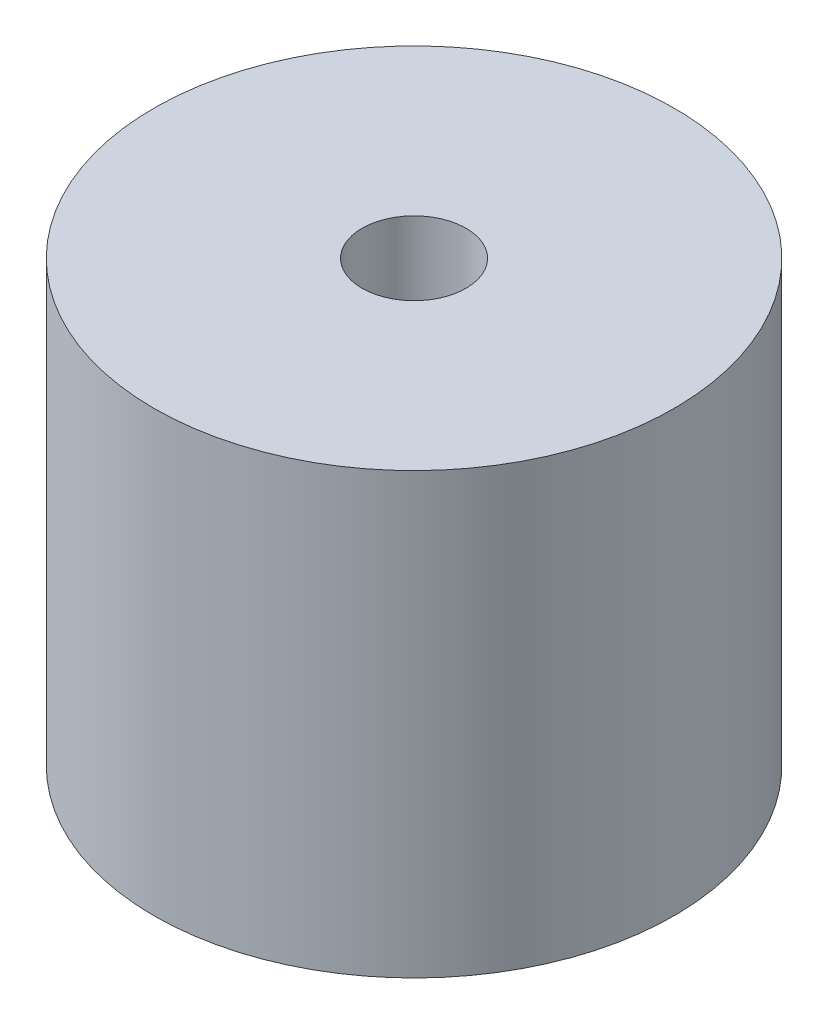
ISO-10303-21;
HEADER;
FILE_DESCRIPTION(('STEP AP214'),'2;1');
FILE_NAME('part.step','',(''),(''),'','','');
FILE_SCHEMA(('AUTOMOTIVE_DESIGN { 1 0 10303 214 1 1 1 1 }'));
ENDSEC;
DATA;
#1=APPLICATION_CONTEXT('core data for automotive mechanical design processes');
#2=APPLICATION_PROTOCOL_DEFINITION('international standard','automotive_design',2000,#1);
#3=PRODUCT_CONTEXT('',#1,'mechanical');
#4=PRODUCT('Part','Part','',(#3));
#5=PRODUCT_RELATED_PRODUCT_CATEGORY('part','',(#4));
#6=PRODUCT_DEFINITION_FORMATION('','',#4);
#7=PRODUCT_DEFINITION_CONTEXT('part definition',#1,'design');
#8=PRODUCT_DEFINITION('design','',#6,#7);
#9=PRODUCT_DEFINITION_SHAPE('','',#8);
#10=(LENGTH_UNIT() NAMED_UNIT(*) SI_UNIT(.MILLI.,.METRE.));
#11=(NAMED_UNIT(*) PLANE_ANGLE_UNIT() SI_UNIT($,.RADIAN.));
#12=(NAMED_UNIT(*) SI_UNIT($,.STERADIAN.) SOLID_ANGLE_UNIT());
#13=UNCERTAINTY_MEASURE_WITH_UNIT(LENGTH_MEASURE(1.E-05),#10,'distance_accuracy_value','');
#14=(GEOMETRIC_REPRESENTATION_CONTEXT(3) GLOBAL_UNCERTAINTY_ASSIGNED_CONTEXT((#13)) GLOBAL_UNIT_ASSIGNED_CONTEXT((#10,
#11,#12)) REPRESENTATION_CONTEXT('',''));
#15=CARTESIAN_POINT('',(0.,0.,0.));
#16=DIRECTION('',(0.,0.,1.));
#17=DIRECTION('',(1.,0.,0.));
#18=AXIS2_PLACEMENT_3D('',#15,#16,#17);
#19=CARTESIAN_POINT('',(0.,13.4112,0.));
#20=DIRECTION('',(0.,1.,0.));
#21=DIRECTION('',(0.,0.,1.));
#22=AXIS2_PLACEMENT_3D('',#19,#20,#21);
#23=PLANE('',#22);
#24=CARTESIAN_POINT('',(0.,13.4112,0.));
#25=DIRECTION('',(0.,1.,0.));
#26=DIRECTION('',(0.,0.,1.));
#27=AXIS2_PLACEMENT_3D('',#24,#25,#26);
#28=CIRCLE('',#27,7.9375);
#29=CARTESIAN_POINT('',(0.,13.4112,7.9375));
#30=VERTEX_POINT('',#29);
#31=EDGE_CURVE('E12',#30,#30,#28,.T.);
#32=ORIENTED_EDGE('',*,*,#31,.T.);
#33=EDGE_LOOP('',(#32));
#34=FACE_BOUND('',#33,.T.);
#35=CARTESIAN_POINT('',(0.,13.4112,0.));
#36=DIRECTION('',(0.,1.,0.));
#37=DIRECTION('',(0.,0.,1.));
#38=AXIS2_PLACEMENT_3D('',#35,#36,#37);
#39=CIRCLE('',#38,1.5875);
#40=CARTESIAN_POINT('',(0.,13.4112,1.5875));
#41=VERTEX_POINT('',#40);
#42=EDGE_CURVE('E52',#41,#41,#39,.T.);
#43=ORIENTED_EDGE('',*,*,#42,.F.);
#44=EDGE_LOOP('',(#43));
#45=FACE_BOUND('',#44,.T.);
#46=ADVANCED_FACE('F41',(#34,#45),#23,.T.);
#47=CARTESIAN_POINT('',(0.,0.,0.));
#48=DIRECTION('',(0.,1.,0.));
#49=DIRECTION('',(0.,0.,1.));
#50=AXIS2_PLACEMENT_3D('',#47,#48,#49);
#51=PLANE('',#50);
#52=CARTESIAN_POINT('',(0.,0.,0.));
#53=DIRECTION('',(0.,1.,0.));
#54=DIRECTION('',(0.,0.,1.));
#55=AXIS2_PLACEMENT_3D('',#52,#53,#54);
#56=CIRCLE('',#55,7.9375);
#57=CARTESIAN_POINT('',(0.,0.,7.9375));
#58=VERTEX_POINT('',#57);
#59=EDGE_CURVE('E45',#58,#58,#56,.T.);
#60=ORIENTED_EDGE('',*,*,#59,.F.);
#61=EDGE_LOOP('',(#60));
#62=FACE_BOUND('',#61,.T.);
#63=CARTESIAN_POINT('',(0.,0.,0.));
#64=DIRECTION('',(0.,1.,0.));
#65=DIRECTION('',(0.,0.,1.));
#66=AXIS2_PLACEMENT_3D('',#63,#64,#65);
#67=CIRCLE('',#66,1.5875);
#68=CARTESIAN_POINT('',(0.,0.,1.5875));
#69=VERTEX_POINT('',#68);
#70=EDGE_CURVE('E54',#69,#69,#67,.T.);
#71=ORIENTED_EDGE('',*,*,#70,.T.);
#72=EDGE_LOOP('',(#71));
#73=FACE_BOUND('',#72,.T.);
#74=ADVANCED_FACE('F64',(#62,#73),#51,.F.);
#75=CARTESIAN_POINT('',(0.,13.4112,0.));
#76=DIRECTION('',(0.,-1.,0.));
#77=DIRECTION('',(0.,0.,-1.));
#78=AXIS2_PLACEMENT_3D('',#75,#76,#77);
#79=CYLINDRICAL_SURFACE('',#78,7.9375);
#80=ORIENTED_EDGE('',*,*,#31,.F.);
#81=EDGE_LOOP('',(#80));
#82=FACE_BOUND('',#81,.T.);
#83=ORIENTED_EDGE('',*,*,#59,.T.);
#84=EDGE_LOOP('',(#83));
#85=FACE_BOUND('',#84,.T.);
#86=ADVANCED_FACE('F43',(#82,#85),#79,.T.);
#87=CARTESIAN_POINT('',(0.,13.4112,0.));
#88=DIRECTION('',(0.,-1.,0.));
#89=DIRECTION('',(0.,0.,-1.));
#90=AXIS2_PLACEMENT_3D('',#87,#88,#89);
#91=CYLINDRICAL_SURFACE('',#90,1.5875);
#92=ORIENTED_EDGE('',*,*,#42,.T.);
#93=EDGE_LOOP('',(#92));
#94=FACE_BOUND('',#93,.T.);
#95=ORIENTED_EDGE('',*,*,#70,.F.);
#96=EDGE_LOOP('',(#95));
#97=FACE_BOUND('',#96,.T.);
#98=ADVANCED_FACE('F60',(#94,#97),#91,.F.);
#99=CLOSED_SHELL('',(#46,#74,#86,#98));
#100=MANIFOLD_SOLID_BREP('B2',#99);
#101=ADVANCED_BREP_SHAPE_REPRESENTATION('',(#18,#100),#14);
#102=SHAPE_DEFINITION_REPRESENTATION(#9,#101);
ENDSEC;
END-ISO-10303-21;
